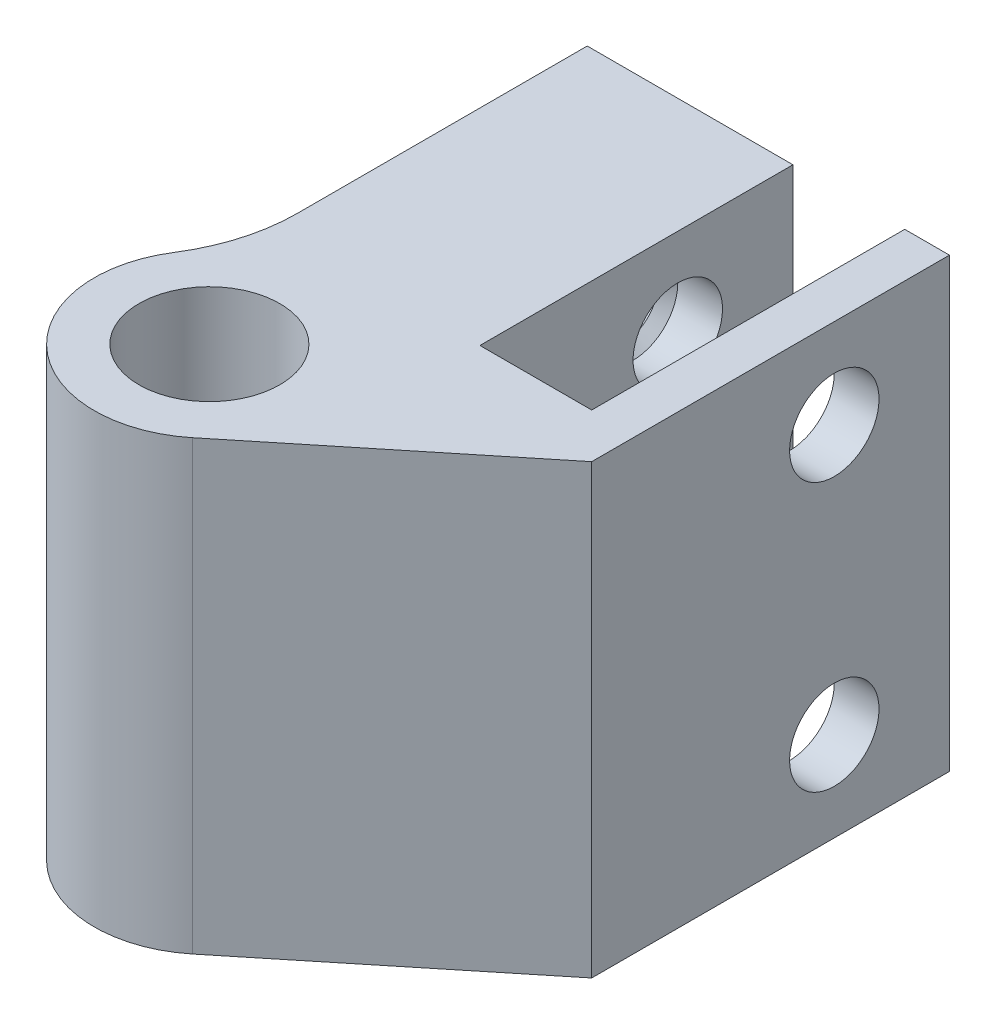
ISO-10303-21;
HEADER;
FILE_DESCRIPTION(('STEP AP214'),'2;1');
FILE_NAME('part.step','',(''),(''),'','','');
FILE_SCHEMA(('AUTOMOTIVE_DESIGN { 1 0 10303 214 1 1 1 1 }'));
ENDSEC;
DATA;
#1=APPLICATION_CONTEXT('core data for automotive mechanical design processes');
#2=APPLICATION_PROTOCOL_DEFINITION('international standard','automotive_design',2000,#1);
#3=PRODUCT_CONTEXT('',#1,'mechanical');
#4=PRODUCT('Part','Part','',(#3));
#5=PRODUCT_RELATED_PRODUCT_CATEGORY('part','',(#4));
#6=PRODUCT_DEFINITION_FORMATION('','',#4);
#7=PRODUCT_DEFINITION_CONTEXT('part definition',#1,'design');
#8=PRODUCT_DEFINITION('design','',#6,#7);
#9=PRODUCT_DEFINITION_SHAPE('','',#8);
#10=(LENGTH_UNIT() NAMED_UNIT(*) SI_UNIT(.MILLI.,.METRE.));
#11=(NAMED_UNIT(*) PLANE_ANGLE_UNIT() SI_UNIT($,.RADIAN.));
#12=(NAMED_UNIT(*) SI_UNIT($,.STERADIAN.) SOLID_ANGLE_UNIT());
#13=UNCERTAINTY_MEASURE_WITH_UNIT(LENGTH_MEASURE(1.E-05),#10,'distance_accuracy_value','');
#14=(GEOMETRIC_REPRESENTATION_CONTEXT(3) GLOBAL_UNCERTAINTY_ASSIGNED_CONTEXT((#13)) GLOBAL_UNIT_ASSIGNED_CONTEXT((#10,
#11,#12)) REPRESENTATION_CONTEXT('',''));
#15=CARTESIAN_POINT('',(0.,0.,0.));
#16=DIRECTION('',(0.,0.,1.));
#17=DIRECTION('',(1.,0.,0.));
#18=AXIS2_PLACEMENT_3D('',#15,#16,#17);
#19=CARTESIAN_POINT('',(0.,25.4,-7.62));
#20=DIRECTION('',(0.,0.,-1.));
#21=DIRECTION('',(-1.,0.,0.));
#22=AXIS2_PLACEMENT_3D('',#19,#20,#21);
#23=PLANE('',#22);
#24=DIRECTION('',(1.,0.,0.));
#25=VECTOR('',#24,1.);
#26=CARTESIAN_POINT('',(0.,0.,-7.62));
#27=LINE('',#26,#25);
#28=CARTESIAN_POINT('',(7.747,0.,-7.62));
#29=VERTEX_POINT('',#28);
#30=CARTESIAN_POINT('',(14.097,0.,-7.62));
#31=VERTEX_POINT('',#30);
#32=EDGE_CURVE('E605',#29,#31,#27,.T.);
#33=ORIENTED_EDGE('',*,*,#32,.F.);
#34=DIRECTION('',(0.,-1.,0.));
#35=VECTOR('',#34,1.);
#36=CARTESIAN_POINT('',(7.747,25.4,-7.62));
#37=LINE('',#36,#35);
#38=CARTESIAN_POINT('',(7.747,25.4,-7.62));
#39=VERTEX_POINT('',#38);
#40=EDGE_CURVE('E423',#39,#29,#37,.T.);
#41=ORIENTED_EDGE('',*,*,#40,.F.);
#42=DIRECTION('',(1.,0.,0.));
#43=VECTOR('',#42,1.);
#44=CARTESIAN_POINT('',(0.,25.4,-7.62));
#45=LINE('',#44,#43);
#46=CARTESIAN_POINT('',(14.097,25.4,-7.62));
#47=VERTEX_POINT('',#46);
#48=EDGE_CURVE('E659',#39,#47,#45,.T.);
#49=ORIENTED_EDGE('',*,*,#48,.T.);
#50=DIRECTION('',(0.,-1.,0.));
#51=VECTOR('',#50,1.);
#52=CARTESIAN_POINT('',(14.097,25.4,-7.62));
#53=LINE('',#52,#51);
#54=EDGE_CURVE('E599',#47,#31,#53,.T.);
#55=ORIENTED_EDGE('',*,*,#54,.T.);
#56=EDGE_LOOP('',(#33,#41,#49,#55));
#57=FACE_BOUND('',#56,.T.);
#58=ADVANCED_FACE('F405',(#57),#23,.T.);
#59=CARTESIAN_POINT('',(0.,25.4,-25.4));
#60=DIRECTION('',(0.,0.,1.));
#61=DIRECTION('',(1.,0.,0.));
#62=AXIS2_PLACEMENT_3D('',#59,#60,#61);
#63=PLANE('',#62);
#64=DIRECTION('',(0.,-1.,0.));
#65=VECTOR('',#64,1.);
#66=CARTESIAN_POINT('',(-3.937,25.4,-25.4));
#67=LINE('',#66,#65);
#68=CARTESIAN_POINT('',(-3.937,25.4,-25.4));
#69=VERTEX_POINT('',#68);
#70=CARTESIAN_POINT('',(-3.937,0.,-25.4));
#71=VERTEX_POINT('',#70);
#72=EDGE_CURVE('E512',#69,#71,#67,.T.);
#73=ORIENTED_EDGE('',*,*,#72,.F.);
#74=DIRECTION('',(-1.,0.,0.));
#75=VECTOR('',#74,1.);
#76=CARTESIAN_POINT('',(0.,25.4,-25.4));
#77=LINE('',#76,#75);
#78=CARTESIAN_POINT('',(7.747,25.4,-25.4));
#79=VERTEX_POINT('',#78);
#80=EDGE_CURVE('E462',#79,#69,#77,.T.);
#81=ORIENTED_EDGE('',*,*,#80,.F.);
#82=DIRECTION('',(0.,-1.,0.));
#83=VECTOR('',#82,1.);
#84=CARTESIAN_POINT('',(7.747,25.4,-25.4));
#85=LINE('',#84,#83);
#86=CARTESIAN_POINT('',(7.747,0.,-25.4));
#87=VERTEX_POINT('',#86);
#88=EDGE_CURVE('E478',#79,#87,#85,.T.);
#89=ORIENTED_EDGE('',*,*,#88,.T.);
#90=DIRECTION('',(-1.,0.,0.));
#91=VECTOR('',#90,1.);
#92=CARTESIAN_POINT('',(0.,0.,-25.4));
#93=LINE('',#92,#91);
#94=EDGE_CURVE('E468',#87,#71,#93,.T.);
#95=ORIENTED_EDGE('',*,*,#94,.T.);
#96=EDGE_LOOP('',(#73,#81,#89,#95));
#97=FACE_BOUND('',#96,.T.);
#98=ADVANCED_FACE('F480',(#97),#63,.F.);
#99=CARTESIAN_POINT('',(0.,25.4,0.));
#100=DIRECTION('',(0.,-1.,0.));
#101=DIRECTION('',(0.,0.,-1.));
#102=AXIS2_PLACEMENT_3D('',#99,#100,#101);
#103=CYLINDRICAL_SURFACE('',#102,6.54);
#104=CARTESIAN_POINT('',(0.,0.,0.));
#105=DIRECTION('',(0.,1.,0.));
#106=DIRECTION('',(0.,0.,1.));
#107=AXIS2_PLACEMENT_3D('',#104,#105,#106);
#108=CIRCLE('',#107,6.54);
#109=CARTESIAN_POINT('',(-5.52062155688623,0.,-3.50632822560055));
#110=VERTEX_POINT('',#109);
#111=CARTESIAN_POINT('',(4.12139504510129,0.,5.07796247349412));
#112=VERTEX_POINT('',#111);
#113=EDGE_CURVE('E669',#110,#112,#108,.T.);
#114=ORIENTED_EDGE('',*,*,#113,.T.);
#115=DIRECTION('',(0.,-1.,0.));
#116=VECTOR('',#115,1.);
#117=CARTESIAN_POINT('',(4.12139504510129,25.4,5.07796247349412));
#118=LINE('',#117,#116);
#119=CARTESIAN_POINT('',(4.12139504510129,25.4,5.07796247349412));
#120=VERTEX_POINT('',#119);
#121=EDGE_CURVE('E623',#120,#112,#118,.T.);
#122=ORIENTED_EDGE('',*,*,#121,.F.);
#123=CARTESIAN_POINT('',(0.,25.4,0.));
#124=DIRECTION('',(0.,1.,0.));
#125=DIRECTION('',(0.,0.,1.));
#126=AXIS2_PLACEMENT_3D('',#123,#124,#125);
#127=CIRCLE('',#126,6.54);
#128=CARTESIAN_POINT('',(-5.52062155688623,25.4,-3.50632822560055));
#129=VERTEX_POINT('',#128);
#130=EDGE_CURVE('E687',#129,#120,#127,.T.);
#131=ORIENTED_EDGE('',*,*,#130,.F.);
#132=DIRECTION('',(0.,-1.,0.));
#133=VECTOR('',#132,1.);
#134=CARTESIAN_POINT('',(-5.52062155688623,25.4,-3.50632822560055));
#135=LINE('',#134,#133);
#136=EDGE_CURVE('E625',#129,#110,#135,.T.);
#137=ORIENTED_EDGE('',*,*,#136,.T.);
#138=EDGE_LOOP('',(#114,#122,#131,#137));
#139=FACE_BOUND('',#138,.T.);
#140=ADVANCED_FACE('F551',(#139),#103,.T.);
#141=CARTESIAN_POINT('',(0.,25.4,0.));
#142=DIRECTION('',(0.,-1.,0.));
#143=DIRECTION('',(0.,0.,-1.));
#144=AXIS2_PLACEMENT_3D('',#141,#142,#143);
#145=CYLINDRICAL_SURFACE('',#144,4.);
#146=CARTESIAN_POINT('',(0.,25.4,0.));
#147=DIRECTION('',(0.,1.,0.));
#148=DIRECTION('',(0.,0.,1.));
#149=AXIS2_PLACEMENT_3D('',#146,#147,#148);
#150=CIRCLE('',#149,4.);
#151=CARTESIAN_POINT('',(0.,25.4,4.));
#152=VERTEX_POINT('',#151);
#153=EDGE_CURVE('E615',#152,#152,#150,.T.);
#154=ORIENTED_EDGE('',*,*,#153,.T.);
#155=EDGE_LOOP('',(#154));
#156=FACE_BOUND('',#155,.T.);
#157=CARTESIAN_POINT('',(0.,0.,0.));
#158=DIRECTION('',(0.,1.,0.));
#159=DIRECTION('',(0.,0.,1.));
#160=AXIS2_PLACEMENT_3D('',#157,#158,#159);
#161=CIRCLE('',#160,4.);
#162=CARTESIAN_POINT('',(0.,0.,4.));
#163=VERTEX_POINT('',#162);
#164=EDGE_CURVE('E608',#163,#163,#161,.T.);
#165=ORIENTED_EDGE('',*,*,#164,.F.);
#166=EDGE_LOOP('',(#165));
#167=FACE_BOUND('',#166,.T.);
#168=ADVANCED_FACE('F554',(#156,#167),#145,.F.);
#169=CARTESIAN_POINT('',(-3.937,25.4,0.));
#170=DIRECTION('',(-1.,0.,0.));
#171=DIRECTION('',(0.,0.,1.));
#172=AXIS2_PLACEMENT_3D('',#169,#170,#171);
#173=PLANE('',#172);
#174=CARTESIAN_POINT('',(-3.937,20.32,-18.8594680990106));
#175=DIRECTION('',(-1.,0.,0.));
#176=DIRECTION('',(0.,0.,1.));
#177=AXIS2_PLACEMENT_3D('',#174,#175,#176);
#178=CIRCLE('',#177,1.984375);
#179=CARTESIAN_POINT('',(-3.937,20.32,-16.8750930990106));
#180=VERTEX_POINT('',#179);
#181=EDGE_CURVE('E504',#180,#180,#178,.T.);
#182=ORIENTED_EDGE('',*,*,#181,.F.);
#183=EDGE_LOOP('',(#182));
#184=FACE_BOUND('',#183,.T.);
#185=CARTESIAN_POINT('',(-3.937,5.08,-18.8594680990106));
#186=DIRECTION('',(-1.,0.,0.));
#187=DIRECTION('',(0.,0.,1.));
#188=AXIS2_PLACEMENT_3D('',#185,#186,#187);
#189=CIRCLE('',#188,1.984375);
#190=CARTESIAN_POINT('',(-3.937,5.08,-16.8750930990106));
#191=VERTEX_POINT('',#190);
#192=EDGE_CURVE('E501',#191,#191,#189,.T.);
#193=ORIENTED_EDGE('',*,*,#192,.F.);
#194=EDGE_LOOP('',(#193));
#195=FACE_BOUND('',#194,.T.);
#196=DIRECTION('',(0.,0.,-1.));
#197=VECTOR('',#196,1.);
#198=CARTESIAN_POINT('',(-3.937,0.,0.));
#199=LINE('',#198,#197);
#200=CARTESIAN_POINT('',(-3.937,0.,-8.95346809901057));
#201=VERTEX_POINT('',#200);
#202=EDGE_CURVE('E476',#201,#71,#199,.T.);
#203=ORIENTED_EDGE('',*,*,#202,.F.);
#204=DIRECTION('',(0.,-1.,0.));
#205=VECTOR('',#204,1.);
#206=CARTESIAN_POINT('',(-3.937,25.4,-8.95346809901057));
#207=LINE('',#206,#205);
#208=CARTESIAN_POINT('',(-3.937,25.4,-8.95346809901057));
#209=VERTEX_POINT('',#208);
#210=EDGE_CURVE('E628',#209,#201,#207,.T.);
#211=ORIENTED_EDGE('',*,*,#210,.F.);
#212=DIRECTION('',(0.,0.,-1.));
#213=VECTOR('',#212,1.);
#214=CARTESIAN_POINT('',(-3.937,25.4,0.));
#215=LINE('',#214,#213);
#216=EDGE_CURVE('E633',#209,#69,#215,.T.);
#217=ORIENTED_EDGE('',*,*,#216,.T.);
#218=ORIENTED_EDGE('',*,*,#72,.T.);
#219=EDGE_LOOP('',(#203,#211,#217,#218));
#220=FACE_BOUND('',#219,.T.);
#221=ADVANCED_FACE('F559',(#184,#195,#220),#173,.T.);
#222=CARTESIAN_POINT('',(-14.097,25.4,-8.95346809901057));
#223=DIRECTION('',(0.,-1.,0.));
#224=DIRECTION('',(0.,0.,-1.));
#225=AXIS2_PLACEMENT_3D('',#222,#223,#224);
#226=CYLINDRICAL_SURFACE('',#225,10.16);
#227=CARTESIAN_POINT('',(-14.097,0.,-8.95346809901057));
#228=DIRECTION('',(0.,1.,0.));
#229=DIRECTION('',(0.,0.,1.));
#230=AXIS2_PLACEMENT_3D('',#227,#228,#229);
#231=CIRCLE('',#230,10.16);
#232=EDGE_CURVE('E667',#201,#110,#231,.F.);
#233=ORIENTED_EDGE('',*,*,#232,.T.);
#234=ORIENTED_EDGE('',*,*,#136,.F.);
#235=CARTESIAN_POINT('',(-14.097,25.4,-8.95346809901057));
#236=DIRECTION('',(0.,1.,0.));
#237=DIRECTION('',(0.,0.,1.));
#238=AXIS2_PLACEMENT_3D('',#235,#236,#237);
#239=CIRCLE('',#238,10.16);
#240=EDGE_CURVE('E686',#209,#129,#239,.F.);
#241=ORIENTED_EDGE('',*,*,#240,.F.);
#242=ORIENTED_EDGE('',*,*,#210,.T.);
#243=EDGE_LOOP('',(#233,#234,#241,#242));
#244=FACE_BOUND('',#243,.T.);
#245=ADVANCED_FACE('F556',(#244),#226,.F.);
#246=CARTESIAN_POINT('',(7.747,25.4,-25.4));
#247=DIRECTION('',(1.,0.,0.));
#248=DIRECTION('',(0.,0.,-1.));
#249=AXIS2_PLACEMENT_3D('',#246,#247,#248);
#250=PLANE('',#249);
#251=CARTESIAN_POINT('',(7.747,20.32,-18.8594680990106));
#252=DIRECTION('',(1.,0.,0.));
#253=DIRECTION('',(0.,0.,-1.));
#254=AXIS2_PLACEMENT_3D('',#251,#252,#253);
#255=CIRCLE('',#254,2.54);
#256=CARTESIAN_POINT('',(7.747,20.32,-21.3994680990106));
#257=VERTEX_POINT('',#256);
#258=EDGE_CURVE('E486',#257,#257,#255,.F.);
#259=ORIENTED_EDGE('',*,*,#258,.T.);
#260=EDGE_LOOP('',(#259));
#261=FACE_BOUND('',#260,.T.);
#262=CARTESIAN_POINT('',(7.747,5.08,-18.8594680990106));
#263=DIRECTION('',(1.,0.,0.));
#264=DIRECTION('',(0.,0.,-1.));
#265=AXIS2_PLACEMENT_3D('',#262,#263,#264);
#266=CIRCLE('',#265,2.54);
#267=CARTESIAN_POINT('',(7.747,5.08,-21.3994680990106));
#268=VERTEX_POINT('',#267);
#269=EDGE_CURVE('E497',#268,#268,#266,.F.);
#270=ORIENTED_EDGE('',*,*,#269,.T.);
#271=EDGE_LOOP('',(#270));
#272=FACE_BOUND('',#271,.T.);
#273=ORIENTED_EDGE('',*,*,#40,.T.);
#274=DIRECTION('',(0.,0.,1.));
#275=VECTOR('',#274,1.);
#276=CARTESIAN_POINT('',(7.747,0.,-25.4));
#277=LINE('',#276,#275);
#278=EDGE_CURVE('E473',#87,#29,#277,.T.);
#279=ORIENTED_EDGE('',*,*,#278,.F.);
#280=ORIENTED_EDGE('',*,*,#88,.F.);
#281=DIRECTION('',(0.,0.,1.));
#282=VECTOR('',#281,1.);
#283=CARTESIAN_POINT('',(7.747,25.4,-25.4));
#284=LINE('',#283,#282);
#285=EDGE_CURVE('E483',#79,#39,#284,.T.);
#286=ORIENTED_EDGE('',*,*,#285,.T.);
#287=EDGE_LOOP('',(#273,#279,#280,#286));
#288=FACE_BOUND('',#287,.T.);
#289=ADVANCED_FACE('F485',(#261,#272,#288),#250,.T.);
#290=CARTESIAN_POINT('',(0.,0.,0.));
#291=DIRECTION('',(0.,1.,0.));
#292=DIRECTION('',(0.,0.,1.));
#293=AXIS2_PLACEMENT_3D('',#290,#291,#292);
#294=PLANE('',#293);
#295=ORIENTED_EDGE('',*,*,#94,.F.);
#296=ORIENTED_EDGE('',*,*,#278,.T.);
#297=ORIENTED_EDGE('',*,*,#32,.T.);
#298=DIRECTION('',(0.,0.,-1.));
#299=VECTOR('',#298,1.);
#300=CARTESIAN_POINT('',(14.097,0.,0.));
#301=LINE('',#300,#299);
#302=CARTESIAN_POINT('',(14.097,0.,-25.4));
#303=VERTEX_POINT('',#302);
#304=EDGE_CURVE('E597',#31,#303,#301,.T.);
#305=ORIENTED_EDGE('',*,*,#304,.T.);
#306=DIRECTION('',(1.,0.,0.));
#307=VECTOR('',#306,1.);
#308=CARTESIAN_POINT('',(0.,0.,-25.4));
#309=LINE('',#308,#307);
#310=CARTESIAN_POINT('',(16.637,0.,-25.4));
#311=VERTEX_POINT('',#310);
#312=EDGE_CURVE('E606',#303,#311,#309,.T.);
#313=ORIENTED_EDGE('',*,*,#312,.T.);
#314=DIRECTION('',(0.,0.,1.));
#315=VECTOR('',#314,1.);
#316=CARTESIAN_POINT('',(16.637,0.,0.));
#317=LINE('',#316,#315);
#318=CARTESIAN_POINT('',(16.637,0.,-5.08));
#319=VERTEX_POINT('',#318);
#320=EDGE_CURVE('E675',#311,#319,#317,.T.);
#321=ORIENTED_EDGE('',*,*,#320,.T.);
#322=DIRECTION('',(-0.776446861390539,0.,0.63018272860876));
#323=VECTOR('',#322,1.);
#324=CARTESIAN_POINT('',(4.12139504510129,0.,5.07796247349412));
#325=LINE('',#324,#323);
#326=EDGE_CURVE('E672',#319,#112,#325,.T.);
#327=ORIENTED_EDGE('',*,*,#326,.T.);
#328=ORIENTED_EDGE('',*,*,#113,.F.);
#329=ORIENTED_EDGE('',*,*,#232,.F.);
#330=ORIENTED_EDGE('',*,*,#202,.T.);
#331=EDGE_LOOP('',(#295,#296,#297,#305,#313,#321,#327,#328,#329,#330));
#332=FACE_BOUND('',#331,.T.);
#333=ORIENTED_EDGE('',*,*,#164,.T.);
#334=EDGE_LOOP('',(#333));
#335=FACE_BOUND('',#334,.T.);
#336=ADVANCED_FACE('F469',(#332,#335),#294,.F.);
#337=CARTESIAN_POINT('',(0.,25.4,0.));
#338=DIRECTION('',(0.,1.,0.));
#339=DIRECTION('',(0.,0.,1.));
#340=AXIS2_PLACEMENT_3D('',#337,#338,#339);
#341=PLANE('',#340);
#342=ORIENTED_EDGE('',*,*,#285,.F.);
#343=ORIENTED_EDGE('',*,*,#80,.T.);
#344=ORIENTED_EDGE('',*,*,#216,.F.);
#345=ORIENTED_EDGE('',*,*,#240,.T.);
#346=ORIENTED_EDGE('',*,*,#130,.T.);
#347=DIRECTION('',(-0.776446861390539,0.,0.63018272860876));
#348=VECTOR('',#347,1.);
#349=CARTESIAN_POINT('',(4.12139504510129,25.4,5.07796247349412));
#350=LINE('',#349,#348);
#351=CARTESIAN_POINT('',(16.637,25.4,-5.08));
#352=VERTEX_POINT('',#351);
#353=EDGE_CURVE('E681',#352,#120,#350,.T.);
#354=ORIENTED_EDGE('',*,*,#353,.F.);
#355=DIRECTION('',(0.,0.,1.));
#356=VECTOR('',#355,1.);
#357=CARTESIAN_POINT('',(16.637,25.4,0.));
#358=LINE('',#357,#356);
#359=CARTESIAN_POINT('',(16.637,25.4,-25.4));
#360=VERTEX_POINT('',#359);
#361=EDGE_CURVE('E657',#360,#352,#358,.T.);
#362=ORIENTED_EDGE('',*,*,#361,.F.);
#363=DIRECTION('',(1.,0.,0.));
#364=VECTOR('',#363,1.);
#365=CARTESIAN_POINT('',(0.,25.4,-25.4));
#366=LINE('',#365,#364);
#367=CARTESIAN_POINT('',(14.097,25.4,-25.4));
#368=VERTEX_POINT('',#367);
#369=EDGE_CURVE('E651',#368,#360,#366,.T.);
#370=ORIENTED_EDGE('',*,*,#369,.F.);
#371=DIRECTION('',(0.,0.,-1.));
#372=VECTOR('',#371,1.);
#373=CARTESIAN_POINT('',(14.097,25.4,0.));
#374=LINE('',#373,#372);
#375=EDGE_CURVE('E655',#47,#368,#374,.T.);
#376=ORIENTED_EDGE('',*,*,#375,.F.);
#377=ORIENTED_EDGE('',*,*,#48,.F.);
#378=EDGE_LOOP('',(#342,#343,#344,#345,#346,#354,#362,#370,#376,#377));
#379=FACE_BOUND('',#378,.T.);
#380=ORIENTED_EDGE('',*,*,#153,.F.);
#381=EDGE_LOOP('',(#380));
#382=FACE_BOUND('',#381,.T.);
#383=ADVANCED_FACE('F536',(#379,#382),#341,.T.);
#384=CARTESIAN_POINT('',(4.12139504510129,25.4,5.07796247349412));
#385=DIRECTION('',(0.63018272860876,0.,0.776446861390539));
#386=DIRECTION('',(0.776446861390539,0.,-0.63018272860876));
#387=AXIS2_PLACEMENT_3D('',#384,#385,#386);
#388=PLANE('',#387);
#389=ORIENTED_EDGE('',*,*,#326,.F.);
#390=DIRECTION('',(0.,-1.,0.));
#391=VECTOR('',#390,1.);
#392=CARTESIAN_POINT('',(16.637,25.4,-5.08));
#393=LINE('',#392,#391);
#394=EDGE_CURVE('E620',#352,#319,#393,.T.);
#395=ORIENTED_EDGE('',*,*,#394,.F.);
#396=ORIENTED_EDGE('',*,*,#353,.T.);
#397=ORIENTED_EDGE('',*,*,#121,.T.);
#398=EDGE_LOOP('',(#389,#395,#396,#397));
#399=FACE_BOUND('',#398,.T.);
#400=ADVANCED_FACE('F533',(#399),#388,.T.);
#401=CARTESIAN_POINT('',(16.637,25.4,0.));
#402=DIRECTION('',(1.,0.,0.));
#403=DIRECTION('',(0.,0.,-1.));
#404=AXIS2_PLACEMENT_3D('',#401,#402,#403);
#405=PLANE('',#404);
#406=CARTESIAN_POINT('',(16.637,20.32,-18.8594680990106));
#407=DIRECTION('',(1.,0.,0.));
#408=DIRECTION('',(0.,0.,-1.));
#409=AXIS2_PLACEMENT_3D('',#406,#407,#408);
#410=CIRCLE('',#409,2.54);
#411=CARTESIAN_POINT('',(16.637,20.32,-21.3994680990106));
#412=VERTEX_POINT('',#411);
#413=EDGE_CURVE('E498',#412,#412,#410,.T.);
#414=ORIENTED_EDGE('',*,*,#413,.F.);
#415=EDGE_LOOP('',(#414));
#416=FACE_BOUND('',#415,.T.);
#417=CARTESIAN_POINT('',(16.637,5.08,-18.8594680990106));
#418=DIRECTION('',(1.,0.,0.));
#419=DIRECTION('',(0.,0.,-1.));
#420=AXIS2_PLACEMENT_3D('',#417,#418,#419);
#421=CIRCLE('',#420,2.54);
#422=CARTESIAN_POINT('',(16.637,5.08,-21.3994680990106));
#423=VERTEX_POINT('',#422);
#424=EDGE_CURVE('E507',#423,#423,#421,.T.);
#425=ORIENTED_EDGE('',*,*,#424,.F.);
#426=EDGE_LOOP('',(#425));
#427=FACE_BOUND('',#426,.T.);
#428=ORIENTED_EDGE('',*,*,#361,.T.);
#429=ORIENTED_EDGE('',*,*,#394,.T.);
#430=ORIENTED_EDGE('',*,*,#320,.F.);
#431=DIRECTION('',(0.,-1.,0.));
#432=VECTOR('',#431,1.);
#433=CARTESIAN_POINT('',(16.637,25.4,-25.4));
#434=LINE('',#433,#432);
#435=EDGE_CURVE('E618',#360,#311,#434,.T.);
#436=ORIENTED_EDGE('',*,*,#435,.F.);
#437=EDGE_LOOP('',(#428,#429,#430,#436));
#438=FACE_BOUND('',#437,.T.);
#439=ADVANCED_FACE('F535',(#416,#427,#438),#405,.T.);
#440=CARTESIAN_POINT('',(0.,25.4,-25.4));
#441=DIRECTION('',(0.,0.,-1.));
#442=DIRECTION('',(-1.,0.,0.));
#443=AXIS2_PLACEMENT_3D('',#440,#441,#442);
#444=PLANE('',#443);
#445=ORIENTED_EDGE('',*,*,#312,.F.);
#446=DIRECTION('',(0.,-1.,0.));
#447=VECTOR('',#446,1.);
#448=CARTESIAN_POINT('',(14.097,25.4,-25.4));
#449=LINE('',#448,#447);
#450=EDGE_CURVE('E602',#368,#303,#449,.T.);
#451=ORIENTED_EDGE('',*,*,#450,.F.);
#452=ORIENTED_EDGE('',*,*,#369,.T.);
#453=ORIENTED_EDGE('',*,*,#435,.T.);
#454=EDGE_LOOP('',(#445,#451,#452,#453));
#455=FACE_BOUND('',#454,.T.);
#456=ADVANCED_FACE('F543',(#455),#444,.T.);
#457=CARTESIAN_POINT('',(14.097,25.4,0.));
#458=DIRECTION('',(-1.,0.,0.));
#459=DIRECTION('',(0.,0.,1.));
#460=AXIS2_PLACEMENT_3D('',#457,#458,#459);
#461=PLANE('',#460);
#462=CARTESIAN_POINT('',(14.097,20.32,-18.8594680990106));
#463=DIRECTION('',(-1.,0.,0.));
#464=DIRECTION('',(0.,0.,1.));
#465=AXIS2_PLACEMENT_3D('',#462,#463,#464);
#466=CIRCLE('',#465,2.54);
#467=CARTESIAN_POINT('',(14.097,20.32,-16.3194680990106));
#468=VERTEX_POINT('',#467);
#469=EDGE_CURVE('E490',#468,#468,#466,.F.);
#470=ORIENTED_EDGE('',*,*,#469,.T.);
#471=EDGE_LOOP('',(#470));
#472=FACE_BOUND('',#471,.T.);
#473=CARTESIAN_POINT('',(14.097,5.08,-18.8594680990106));
#474=DIRECTION('',(-1.,0.,0.));
#475=DIRECTION('',(0.,0.,1.));
#476=AXIS2_PLACEMENT_3D('',#473,#474,#475);
#477=CIRCLE('',#476,2.54);
#478=CARTESIAN_POINT('',(14.097,5.08,-16.3194680990106));
#479=VERTEX_POINT('',#478);
#480=EDGE_CURVE('E494',#479,#479,#477,.F.);
#481=ORIENTED_EDGE('',*,*,#480,.T.);
#482=EDGE_LOOP('',(#481));
#483=FACE_BOUND('',#482,.T.);
#484=ORIENTED_EDGE('',*,*,#304,.F.);
#485=ORIENTED_EDGE('',*,*,#54,.F.);
#486=ORIENTED_EDGE('',*,*,#375,.T.);
#487=ORIENTED_EDGE('',*,*,#450,.T.);
#488=EDGE_LOOP('',(#484,#485,#486,#487));
#489=FACE_BOUND('',#488,.T.);
#490=ADVANCED_FACE('F575',(#472,#483,#489),#461,.T.);
#491=CARTESIAN_POINT('',(16.637,5.08,-18.8594680990106));
#492=DIRECTION('',(-1.,0.,0.));
#493=DIRECTION('',(0.,0.,1.));
#494=AXIS2_PLACEMENT_3D('',#491,#492,#493);
#495=CYLINDRICAL_SURFACE('',#494,2.54);
#496=ORIENTED_EDGE('',*,*,#480,.F.);
#497=EDGE_LOOP('',(#496));
#498=FACE_BOUND('',#497,.T.);
#499=ORIENTED_EDGE('',*,*,#424,.T.);
#500=EDGE_LOOP('',(#499));
#501=FACE_BOUND('',#500,.T.);
#502=ADVANCED_FACE('F561',(#498,#501),#495,.F.);
#503=CARTESIAN_POINT('',(16.637,20.32,-18.8594680990106));
#504=DIRECTION('',(-1.,0.,0.));
#505=DIRECTION('',(0.,0.,1.));
#506=AXIS2_PLACEMENT_3D('',#503,#504,#505);
#507=CYLINDRICAL_SURFACE('',#506,2.54);
#508=ORIENTED_EDGE('',*,*,#469,.F.);
#509=EDGE_LOOP('',(#508));
#510=FACE_BOUND('',#509,.T.);
#511=ORIENTED_EDGE('',*,*,#413,.T.);
#512=EDGE_LOOP('',(#511));
#513=FACE_BOUND('',#512,.T.);
#514=ADVANCED_FACE('F586',(#510,#513),#507,.F.);
#515=CARTESIAN_POINT('',(5.20700000000001,5.08,-18.8594680990106));
#516=DIRECTION('',(1.,0.,0.));
#517=DIRECTION('',(0.,0.,-1.));
#518=AXIS2_PLACEMENT_3D('',#515,#516,#517);
#519=CIRCLE('',#518,2.54);
#520=CARTESIAN_POINT('',(5.20700000000001,5.08,-21.3994680990106));
#521=VERTEX_POINT('',#520);
#522=EDGE_CURVE('E511',#521,#521,#519,.F.);
#523=ORIENTED_EDGE('',*,*,#522,.T.);
#524=EDGE_LOOP('',(#523));
#525=FACE_BOUND('',#524,.T.);
#526=ORIENTED_EDGE('',*,*,#269,.F.);
#527=EDGE_LOOP('',(#526));
#528=FACE_BOUND('',#527,.T.);
#529=ADVANCED_FACE('F589',(#525,#528),#495,.F.);
#530=CARTESIAN_POINT('',(5.20700000000001,20.32,-18.8594680990106));
#531=DIRECTION('',(1.,0.,0.));
#532=DIRECTION('',(0.,0.,-1.));
#533=AXIS2_PLACEMENT_3D('',#530,#531,#532);
#534=CIRCLE('',#533,2.54);
#535=CARTESIAN_POINT('',(5.20700000000001,20.32,-21.3994680990106));
#536=VERTEX_POINT('',#535);
#537=EDGE_CURVE('E508',#536,#536,#534,.F.);
#538=ORIENTED_EDGE('',*,*,#537,.T.);
#539=EDGE_LOOP('',(#538));
#540=FACE_BOUND('',#539,.T.);
#541=ORIENTED_EDGE('',*,*,#258,.F.);
#542=EDGE_LOOP('',(#541));
#543=FACE_BOUND('',#542,.T.);
#544=ADVANCED_FACE('F707',(#540,#543),#507,.F.);
#545=CARTESIAN_POINT('',(-6.54,5.08,-18.8594680990106));
#546=DIRECTION('',(1.,0.,0.));
#547=DIRECTION('',(0.,0.,-1.));
#548=AXIS2_PLACEMENT_3D('',#545,#546,#547);
#549=CYLINDRICAL_SURFACE('',#548,1.984375);
#550=CARTESIAN_POINT('',(4.65137500000001,5.08,-18.8594680990106));
#551=DIRECTION('',(1.,0.,0.));
#552=DIRECTION('',(0.,0.,-1.));
#553=AXIS2_PLACEMENT_3D('',#550,#551,#552);
#554=CIRCLE('',#553,1.984375);
#555=CARTESIAN_POINT('',(4.65137500000001,5.08,-20.8438430990106));
#556=VERTEX_POINT('',#555);
#557=EDGE_CURVE('E12',#556,#556,#554,.T.);
#558=ORIENTED_EDGE('',*,*,#557,.T.);
#559=EDGE_LOOP('',(#558));
#560=FACE_BOUND('',#559,.T.);
#561=ORIENTED_EDGE('',*,*,#192,.T.);
#562=EDGE_LOOP('',(#561));
#563=FACE_BOUND('',#562,.T.);
#564=ADVANCED_FACE('F528',(#560,#563),#549,.F.);
#565=CARTESIAN_POINT('',(-6.54,20.32,-18.8594680990106));
#566=DIRECTION('',(1.,0.,0.));
#567=DIRECTION('',(0.,0.,-1.));
#568=AXIS2_PLACEMENT_3D('',#565,#566,#567);
#569=CYLINDRICAL_SURFACE('',#568,1.984375);
#570=CARTESIAN_POINT('',(4.65137500000001,20.32,-18.8594680990106));
#571=DIRECTION('',(1.,0.,0.));
#572=DIRECTION('',(0.,0.,-1.));
#573=AXIS2_PLACEMENT_3D('',#570,#571,#572);
#574=CIRCLE('',#573,1.984375);
#575=CARTESIAN_POINT('',(4.65137500000001,20.32,-20.8438430990106));
#576=VERTEX_POINT('',#575);
#577=EDGE_CURVE('E415',#576,#576,#574,.T.);
#578=ORIENTED_EDGE('',*,*,#577,.T.);
#579=EDGE_LOOP('',(#578));
#580=FACE_BOUND('',#579,.T.);
#581=ORIENTED_EDGE('',*,*,#181,.T.);
#582=EDGE_LOOP('',(#581));
#583=FACE_BOUND('',#582,.T.);
#584=ADVANCED_FACE('F517',(#580,#583),#569,.F.);
#585=CARTESIAN_POINT('',(3.937,20.32,-18.8594680990106));
#586=DIRECTION('',(1.,0.,0.));
#587=DIRECTION('',(0.,0.,-1.));
#588=AXIS2_PLACEMENT_3D('',#585,#586,#587);
#589=CONICAL_SURFACE('',#588,1.26999999999998,0.785398163397453);
#590=CARTESIAN_POINT('',(5.20700000000001,20.32,-21.3994680990106));
#591=CARTESIAN_POINT('',(5.20121223958334,20.32,-21.3936803385939));
#592=CARTESIAN_POINT('',(5.19542447916668,20.32,-21.3878925781772));
#593=CARTESIAN_POINT('',(5.18384895833334,20.32,-21.3763170573439));
#594=CARTESIAN_POINT('',(5.17806119791668,20.32,-21.3705292969272));
#595=CARTESIAN_POINT('',(5.16648567708334,20.32,-21.3589537760939));
#596=CARTESIAN_POINT('',(5.16069791666668,20.32,-21.3531660156772));
#597=CARTESIAN_POINT('',(5.14912239583334,20.32,-21.3415904948439));
#598=CARTESIAN_POINT('',(5.14333463541668,20.32,-21.3358027344272));
#599=CARTESIAN_POINT('',(5.13175911458334,20.32,-21.3242272135939));
#600=CARTESIAN_POINT('',(5.12597135416668,20.32,-21.3184394531772));
#601=CARTESIAN_POINT('',(5.11439583333334,20.32,-21.3068639323439));
#602=CARTESIAN_POINT('',(5.10860807291668,20.32,-21.3010761719272));
#603=CARTESIAN_POINT('',(5.09703255208334,20.32,-21.2895006510939));
#604=CARTESIAN_POINT('',(5.09124479166668,20.32,-21.2837128906772));
#605=CARTESIAN_POINT('',(5.07966927083334,20.32,-21.2721373698439));
#606=CARTESIAN_POINT('',(5.07388151041668,20.32,-21.2663496094272));
#607=CARTESIAN_POINT('',(5.06230598958334,20.32,-21.2547740885939));
#608=CARTESIAN_POINT('',(5.05651822916668,20.32,-21.2489863281772));
#609=CARTESIAN_POINT('',(5.04494270833334,20.32,-21.2374108073439));
#610=CARTESIAN_POINT('',(5.03915494791668,20.32,-21.2316230469272));
#611=CARTESIAN_POINT('',(5.02757942708334,20.32,-21.2200475260939));
#612=CARTESIAN_POINT('',(5.02179166666668,20.32,-21.2142597656772));
#613=CARTESIAN_POINT('',(5.01021614583334,20.32,-21.2026842448439));
#614=CARTESIAN_POINT('',(5.00442838541668,20.32,-21.1968964844272));
#615=CARTESIAN_POINT('',(4.99285286458334,20.32,-21.1853209635939));
#616=CARTESIAN_POINT('',(4.98706510416668,20.32,-21.1795332031772));
#617=CARTESIAN_POINT('',(4.97548958333334,20.32,-21.1679576823439));
#618=CARTESIAN_POINT('',(4.96970182291668,20.32,-21.1621699219272));
#619=CARTESIAN_POINT('',(4.95812630208334,20.32,-21.1505944010939));
#620=CARTESIAN_POINT('',(4.95233854166668,20.32,-21.1448066406772));
#621=CARTESIAN_POINT('',(4.94076302083334,20.32,-21.1332311198439));
#622=CARTESIAN_POINT('',(4.93497526041668,20.32,-21.1274433594272));
#623=CARTESIAN_POINT('',(4.92339973958334,20.32,-21.1158678385939));
#624=CARTESIAN_POINT('',(4.91761197916668,20.32,-21.1100800781772));
#625=CARTESIAN_POINT('',(4.90603645833334,20.32,-21.0985045573439));
#626=CARTESIAN_POINT('',(4.90024869791668,20.32,-21.0927167969272));
#627=CARTESIAN_POINT('',(4.88867317708334,20.32,-21.0811412760939));
#628=CARTESIAN_POINT('',(4.88288541666668,20.32,-21.0753535156772));
#629=CARTESIAN_POINT('',(4.87130989583334,20.32,-21.0637779948439));
#630=CARTESIAN_POINT('',(4.86552213541668,20.32,-21.0579902344272));
#631=CARTESIAN_POINT('',(4.85394661458334,20.32,-21.0464147135939));
#632=CARTESIAN_POINT('',(4.84815885416668,20.32,-21.0406269531772));
#633=CARTESIAN_POINT('',(4.83658333333334,20.32,-21.0290514323439));
#634=CARTESIAN_POINT('',(4.83079557291668,20.32,-21.0232636719272));
#635=CARTESIAN_POINT('',(4.81922005208334,20.32,-21.0116881510939));
#636=CARTESIAN_POINT('',(4.81343229166668,20.32,-21.0059003906772));
#637=CARTESIAN_POINT('',(4.80185677083334,20.32,-20.9943248698439));
#638=CARTESIAN_POINT('',(4.79606901041668,20.32,-20.9885371094272));
#639=CARTESIAN_POINT('',(4.78449348958334,20.32,-20.9769615885939));
#640=CARTESIAN_POINT('',(4.77870572916668,20.32,-20.9711738281772));
#641=CARTESIAN_POINT('',(4.76713020833334,20.32,-20.9595983073439));
#642=CARTESIAN_POINT('',(4.76134244791668,20.32,-20.9538105469272));
#643=CARTESIAN_POINT('',(4.74976692708334,20.32,-20.9422350260939));
#644=CARTESIAN_POINT('',(4.74397916666668,20.32,-20.9364472656772));
#645=CARTESIAN_POINT('',(4.73240364583334,20.32,-20.9248717448439));
#646=CARTESIAN_POINT('',(4.72661588541668,20.32,-20.9190839844272));
#647=CARTESIAN_POINT('',(4.71504036458334,20.32,-20.9075084635939));
#648=CARTESIAN_POINT('',(4.70925260416668,20.32,-20.9017207031772));
#649=CARTESIAN_POINT('',(4.69767708333334,20.32,-20.8901451823439));
#650=CARTESIAN_POINT('',(4.69188932291668,20.32,-20.8843574219272));
#651=CARTESIAN_POINT('',(4.68031380208334,20.32,-20.8727819010939));
#652=CARTESIAN_POINT('',(4.67452604166668,20.32,-20.8669941406772));
#653=CARTESIAN_POINT('',(4.66295052083334,20.32,-20.8554186198439));
#654=CARTESIAN_POINT('',(4.65716276041668,20.32,-20.8496308594272));
#655=CARTESIAN_POINT('',(4.65137500000001,20.32,-20.8438430990106));
#656=B_SPLINE_CURVE_WITH_KNOTS('',3,(#590,#591,#592,#593,#594,#595,#596,#597,#598,#599,#600,
#601,#602,#603,#604,#605,#606,#607,#608,#609,#610,#611,#612,#613,#614,#615,#616,#617,#618,#619,
#620,#621,#622,#623,#624,#625,#626,#627,#628,#629,#630,#631,#632,#633,#634,#635,#636,#637,#638,
#639,#640,#641,#642,#643,#644,#645,#646,#647,#648,#649,#650,#651,#652,#653,#654,#655),
.UNSPECIFIED.,.F.,.F.,(4,2,2,2,2,2,2,2,2,2,2,2,2,2,2,2,2,2,2,2,2,2,2,2,2,2,2,2,2,2,2,2,4),(0.,
0.0245553878310468,0.0491107756620942,0.0736661634931441,0.098221551324194,0.122776939155241,
0.147332326986289,0.171887714817339,0.196443102648388,0.220998490479435,0.245553878310483,
0.270109266141533,0.294664653972582,0.319220041803629,0.343775429634677,0.368330817465727,
0.392886205296776,0.417441593127823,0.441996980958871,0.466552368789921,0.491107756620971,
0.515663144452018,0.540218532283065,0.564773920114115,0.589329307945164,0.613884695776212,
0.638440083607259,0.662995471438309,0.687550859269358,0.712106247100406,0.736661634931453,
0.761217022762503,0.785772410593553),.UNSPECIFIED.);
#657=EDGE_CURVE('BSEAM520',#536,#576,#656,.T.);
#658=ORIENTED_EDGE('',*,*,#537,.F.);
#659=ORIENTED_EDGE('',*,*,#577,.F.);
#660=ORIENTED_EDGE('',*,*,#657,.T.);
#661=ORIENTED_EDGE('',*,*,#657,.F.);
#662=EDGE_LOOP('',(#658,#660,#659,#661));
#663=FACE_BOUND('',#662,.T.);
#664=ADVANCED_FACE('F520',(#663),#589,.F.);
#665=CARTESIAN_POINT('',(3.937,5.08,-18.8594680990106));
#666=DIRECTION('',(1.,0.,0.));
#667=DIRECTION('',(0.,0.,-1.));
#668=AXIS2_PLACEMENT_3D('',#665,#666,#667);
#669=CONICAL_SURFACE('',#668,1.26999999999998,0.785398163397453);
#670=CARTESIAN_POINT('',(5.20700000000001,5.08,-21.3994680990106));
#671=CARTESIAN_POINT('',(5.20121223958334,5.08,-21.3936803385939));
#672=CARTESIAN_POINT('',(5.19542447916668,5.08,-21.3878925781772));
#673=CARTESIAN_POINT('',(5.18384895833334,5.08,-21.3763170573439));
#674=CARTESIAN_POINT('',(5.17806119791668,5.08,-21.3705292969272));
#675=CARTESIAN_POINT('',(5.16648567708334,5.08,-21.3589537760939));
#676=CARTESIAN_POINT('',(5.16069791666668,5.08,-21.3531660156772));
#677=CARTESIAN_POINT('',(5.14912239583334,5.08,-21.3415904948439));
#678=CARTESIAN_POINT('',(5.14333463541668,5.08,-21.3358027344272));
#679=CARTESIAN_POINT('',(5.13175911458334,5.08,-21.3242272135939));
#680=CARTESIAN_POINT('',(5.12597135416668,5.08,-21.3184394531772));
#681=CARTESIAN_POINT('',(5.11439583333334,5.08,-21.3068639323439));
#682=CARTESIAN_POINT('',(5.10860807291668,5.08,-21.3010761719272));
#683=CARTESIAN_POINT('',(5.09703255208334,5.08,-21.2895006510939));
#684=CARTESIAN_POINT('',(5.09124479166668,5.08,-21.2837128906772));
#685=CARTESIAN_POINT('',(5.07966927083334,5.08,-21.2721373698439));
#686=CARTESIAN_POINT('',(5.07388151041668,5.08,-21.2663496094272));
#687=CARTESIAN_POINT('',(5.06230598958334,5.08,-21.2547740885939));
#688=CARTESIAN_POINT('',(5.05651822916668,5.08,-21.2489863281772));
#689=CARTESIAN_POINT('',(5.04494270833334,5.08,-21.2374108073439));
#690=CARTESIAN_POINT('',(5.03915494791668,5.08,-21.2316230469272));
#691=CARTESIAN_POINT('',(5.02757942708334,5.08,-21.2200475260939));
#692=CARTESIAN_POINT('',(5.02179166666668,5.08,-21.2142597656772));
#693=CARTESIAN_POINT('',(5.01021614583334,5.08,-21.2026842448439));
#694=CARTESIAN_POINT('',(5.00442838541668,5.08,-21.1968964844272));
#695=CARTESIAN_POINT('',(4.99285286458334,5.08,-21.1853209635939));
#696=CARTESIAN_POINT('',(4.98706510416668,5.08,-21.1795332031772));
#697=CARTESIAN_POINT('',(4.97548958333334,5.08,-21.1679576823439));
#698=CARTESIAN_POINT('',(4.96970182291668,5.08,-21.1621699219272));
#699=CARTESIAN_POINT('',(4.95812630208334,5.08,-21.1505944010939));
#700=CARTESIAN_POINT('',(4.95233854166668,5.08,-21.1448066406772));
#701=CARTESIAN_POINT('',(4.94076302083334,5.08,-21.1332311198439));
#702=CARTESIAN_POINT('',(4.93497526041668,5.08,-21.1274433594272));
#703=CARTESIAN_POINT('',(4.92339973958334,5.08,-21.1158678385939));
#704=CARTESIAN_POINT('',(4.91761197916668,5.08,-21.1100800781772));
#705=CARTESIAN_POINT('',(4.90603645833334,5.08,-21.0985045573439));
#706=CARTESIAN_POINT('',(4.90024869791668,5.08,-21.0927167969272));
#707=CARTESIAN_POINT('',(4.88867317708334,5.08,-21.0811412760939));
#708=CARTESIAN_POINT('',(4.88288541666668,5.08,-21.0753535156772));
#709=CARTESIAN_POINT('',(4.87130989583334,5.08,-21.0637779948439));
#710=CARTESIAN_POINT('',(4.86552213541668,5.08,-21.0579902344272));
#711=CARTESIAN_POINT('',(4.85394661458334,5.08,-21.0464147135939));
#712=CARTESIAN_POINT('',(4.84815885416668,5.08,-21.0406269531772));
#713=CARTESIAN_POINT('',(4.83658333333334,5.08,-21.0290514323439));
#714=CARTESIAN_POINT('',(4.83079557291668,5.08,-21.0232636719272));
#715=CARTESIAN_POINT('',(4.81922005208334,5.08,-21.0116881510939));
#716=CARTESIAN_POINT('',(4.81343229166668,5.08,-21.0059003906772));
#717=CARTESIAN_POINT('',(4.80185677083334,5.08,-20.9943248698439));
#718=CARTESIAN_POINT('',(4.79606901041668,5.08,-20.9885371094272));
#719=CARTESIAN_POINT('',(4.78449348958334,5.08,-20.9769615885939));
#720=CARTESIAN_POINT('',(4.77870572916668,5.08,-20.9711738281772));
#721=CARTESIAN_POINT('',(4.76713020833334,5.08,-20.9595983073439));
#722=CARTESIAN_POINT('',(4.76134244791668,5.08,-20.9538105469272));
#723=CARTESIAN_POINT('',(4.74976692708334,5.08,-20.9422350260939));
#724=CARTESIAN_POINT('',(4.74397916666668,5.08,-20.9364472656772));
#725=CARTESIAN_POINT('',(4.73240364583334,5.08,-20.9248717448439));
#726=CARTESIAN_POINT('',(4.72661588541668,5.08,-20.9190839844272));
#727=CARTESIAN_POINT('',(4.71504036458334,5.08,-20.9075084635939));
#728=CARTESIAN_POINT('',(4.70925260416668,5.08,-20.9017207031772));
#729=CARTESIAN_POINT('',(4.69767708333334,5.08,-20.8901451823439));
#730=CARTESIAN_POINT('',(4.69188932291668,5.08,-20.8843574219272));
#731=CARTESIAN_POINT('',(4.68031380208334,5.08,-20.8727819010939));
#732=CARTESIAN_POINT('',(4.67452604166668,5.08,-20.8669941406772));
#733=CARTESIAN_POINT('',(4.66295052083334,5.08,-20.8554186198439));
#734=CARTESIAN_POINT('',(4.65716276041668,5.08,-20.8496308594272));
#735=CARTESIAN_POINT('',(4.65137500000001,5.08,-20.8438430990106));
#736=B_SPLINE_CURVE_WITH_KNOTS('',3,(#670,#671,#672,#673,#674,#675,#676,#677,#678,#679,#680,
#681,#682,#683,#684,#685,#686,#687,#688,#689,#690,#691,#692,#693,#694,#695,#696,#697,#698,#699,
#700,#701,#702,#703,#704,#705,#706,#707,#708,#709,#710,#711,#712,#713,#714,#715,#716,#717,#718,
#719,#720,#721,#722,#723,#724,#725,#726,#727,#728,#729,#730,#731,#732,#733,#734,#735),
.UNSPECIFIED.,.F.,.F.,(4,2,2,2,2,2,2,2,2,2,2,2,2,2,2,2,2,2,2,2,2,2,2,2,2,2,2,2,2,2,2,2,4),(0.,
0.0245553878310468,0.0491107756620942,0.0736661634931441,0.098221551324194,0.122776939155241,
0.147332326986289,0.171887714817339,0.196443102648388,0.220998490479435,0.245553878310483,
0.270109266141533,0.294664653972582,0.319220041803629,0.343775429634677,0.368330817465727,
0.392886205296776,0.417441593127823,0.441996980958871,0.466552368789921,0.491107756620971,
0.515663144452018,0.540218532283065,0.564773920114115,0.589329307945164,0.613884695776212,
0.638440083607259,0.662995471438309,0.687550859269358,0.712106247100406,0.736661634931453,
0.761217022762503,0.785772410593553),.UNSPECIFIED.);
#737=EDGE_CURVE('BSEAM408',#521,#556,#736,.T.);
#738=ORIENTED_EDGE('',*,*,#522,.F.);
#739=ORIENTED_EDGE('',*,*,#557,.F.);
#740=ORIENTED_EDGE('',*,*,#737,.T.);
#741=ORIENTED_EDGE('',*,*,#737,.F.);
#742=EDGE_LOOP('',(#738,#740,#739,#741));
#743=FACE_BOUND('',#742,.T.);
#744=ADVANCED_FACE('F408',(#743),#669,.F.);
#745=CLOSED_SHELL('',(#58,#98,#140,#168,#221,#245,#289,#336,#383,#400,#439,#456,#490,#502,#514,
#529,#544,#564,#584,#664,#744));
#746=MANIFOLD_SOLID_BREP('B2',#745);
#747=ADVANCED_BREP_SHAPE_REPRESENTATION('',(#18,#746),#14);
#748=SHAPE_DEFINITION_REPRESENTATION(#9,#747);
ENDSEC;
END-ISO-10303-21;
